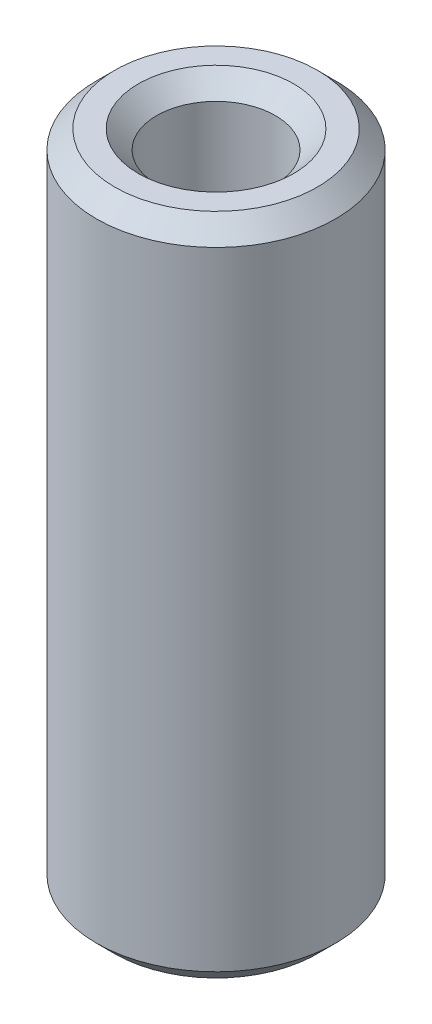
ISO-10303-21;
HEADER;
FILE_DESCRIPTION(('STEP AP214'),'2;1');
FILE_NAME('part.step','',(''),(''),'','','');
FILE_SCHEMA(('AUTOMOTIVE_DESIGN { 1 0 10303 214 1 1 1 1 }'));
ENDSEC;
DATA;
#1=APPLICATION_CONTEXT('core data for automotive mechanical design processes');
#2=APPLICATION_PROTOCOL_DEFINITION('international standard','automotive_design',2000,#1);
#3=PRODUCT_CONTEXT('',#1,'mechanical');
#4=PRODUCT('Part','Part','',(#3));
#5=PRODUCT_RELATED_PRODUCT_CATEGORY('part','',(#4));
#6=PRODUCT_DEFINITION_FORMATION('','',#4);
#7=PRODUCT_DEFINITION_CONTEXT('part definition',#1,'design');
#8=PRODUCT_DEFINITION('design','',#6,#7);
#9=PRODUCT_DEFINITION_SHAPE('','',#8);
#10=(LENGTH_UNIT() NAMED_UNIT(*) SI_UNIT(.MILLI.,.METRE.));
#11=(NAMED_UNIT(*) PLANE_ANGLE_UNIT() SI_UNIT($,.RADIAN.));
#12=(NAMED_UNIT(*) SI_UNIT($,.STERADIAN.) SOLID_ANGLE_UNIT());
#13=UNCERTAINTY_MEASURE_WITH_UNIT(LENGTH_MEASURE(1.E-05),#10,'distance_accuracy_value','');
#14=(GEOMETRIC_REPRESENTATION_CONTEXT(3) GLOBAL_UNCERTAINTY_ASSIGNED_CONTEXT((#13)) GLOBAL_UNIT_ASSIGNED_CONTEXT((#10,
#11,#12)) REPRESENTATION_CONTEXT('',''));
#15=CARTESIAN_POINT('',(0.,0.,0.));
#16=DIRECTION('',(0.,0.,1.));
#17=DIRECTION('',(1.,0.,0.));
#18=AXIS2_PLACEMENT_3D('',#15,#16,#17);
#19=CARTESIAN_POINT('',(0.,138.766618635159,0.));
#20=DIRECTION('',(0.,-1.,0.));
#21=DIRECTION('',(0.,0.,-1.));
#22=AXIS2_PLACEMENT_3D('',#19,#20,#21);
#23=CYLINDRICAL_SURFACE('',#22,25.);
#24=CARTESIAN_POINT('',(0.,3.83094372127921,0.));
#25=DIRECTION('',(0.,1.,0.));
#26=DIRECTION('',(0.,0.,1.));
#27=AXIS2_PLACEMENT_3D('',#24,#25,#26);
#28=CIRCLE('',#27,25.);
#29=CARTESIAN_POINT('',(0.,3.83094372127921,25.));
#30=VERTEX_POINT('',#29);
#31=EDGE_CURVE('E10',#30,#30,#28,.T.);
#32=ORIENTED_EDGE('',*,*,#31,.T.);
#33=EDGE_LOOP('',(#32));
#34=FACE_BOUND('',#33,.T.);
#35=CARTESIAN_POINT('',(0.,134.93567491388,0.));
#36=DIRECTION('',(0.,1.,0.));
#37=DIRECTION('',(0.,0.,1.));
#38=AXIS2_PLACEMENT_3D('',#35,#36,#37);
#39=CIRCLE('',#38,25.);
#40=CARTESIAN_POINT('',(0.,134.93567491388,25.));
#41=VERTEX_POINT('',#40);
#42=EDGE_CURVE('E50',#41,#41,#39,.F.);
#43=ORIENTED_EDGE('',*,*,#42,.T.);
#44=EDGE_LOOP('',(#43));
#45=FACE_BOUND('',#44,.T.);
#46=ADVANCED_FACE('F39',(#34,#45),#23,.T.);
#47=CARTESIAN_POINT('',(0.,138.766618635159,0.));
#48=DIRECTION('',(0.,1.,0.));
#49=DIRECTION('',(0.,0.,1.));
#50=AXIS2_PLACEMENT_3D('',#47,#48,#49);
#51=PLANE('',#50);
#52=CARTESIAN_POINT('',(0.,138.766618635159,0.));
#53=DIRECTION('',(0.,1.,0.));
#54=DIRECTION('',(0.,0.,1.));
#55=AXIS2_PLACEMENT_3D('',#52,#53,#54);
#56=CIRCLE('',#55,16.2453416681591);
#57=CARTESIAN_POINT('',(0.,138.766618635159,16.2453416681591));
#58=VERTEX_POINT('',#57);
#59=EDGE_CURVE('E58',#58,#58,#56,.F.);
#60=ORIENTED_EDGE('',*,*,#59,.T.);
#61=EDGE_LOOP('',(#60));
#62=FACE_BOUND('',#61,.T.);
#63=CARTESIAN_POINT('',(0.,138.766618635159,0.));
#64=DIRECTION('',(0.,1.,0.));
#65=DIRECTION('',(0.,0.,1.));
#66=AXIS2_PLACEMENT_3D('',#63,#64,#65);
#67=CIRCLE('',#66,21.1690562787208);
#68=CARTESIAN_POINT('',(0.,138.766618635159,21.1690562787208));
#69=VERTEX_POINT('',#68);
#70=EDGE_CURVE('E61',#69,#69,#67,.T.);
#71=ORIENTED_EDGE('',*,*,#70,.T.);
#72=EDGE_LOOP('',(#71));
#73=FACE_BOUND('',#72,.T.);
#74=ADVANCED_FACE('F88',(#62,#73),#51,.T.);
#75=CARTESIAN_POINT('',(0.,0.,0.));
#76=DIRECTION('',(0.,1.,0.));
#77=DIRECTION('',(0.,0.,1.));
#78=AXIS2_PLACEMENT_3D('',#75,#76,#77);
#79=PLANE('',#78);
#80=CARTESIAN_POINT('',(0.,0.,0.));
#81=DIRECTION('',(0.,1.,0.));
#82=DIRECTION('',(0.,0.,1.));
#83=AXIS2_PLACEMENT_3D('',#80,#81,#82);
#84=CIRCLE('',#83,16.2453416681591);
#85=CARTESIAN_POINT('',(0.,0.,16.2453416681591));
#86=VERTEX_POINT('',#85);
#87=EDGE_CURVE('E51',#86,#86,#84,.T.);
#88=ORIENTED_EDGE('',*,*,#87,.T.);
#89=EDGE_LOOP('',(#88));
#90=FACE_BOUND('',#89,.T.);
#91=CARTESIAN_POINT('',(0.,0.,0.));
#92=DIRECTION('',(0.,1.,0.));
#93=DIRECTION('',(0.,0.,1.));
#94=AXIS2_PLACEMENT_3D('',#91,#92,#93);
#95=CIRCLE('',#94,21.1690562787208);
#96=CARTESIAN_POINT('',(0.,0.,21.1690562787208));
#97=VERTEX_POINT('',#96);
#98=EDGE_CURVE('E54',#97,#97,#95,.F.);
#99=ORIENTED_EDGE('',*,*,#98,.T.);
#100=EDGE_LOOP('',(#99));
#101=FACE_BOUND('',#100,.T.);
#102=ADVANCED_FACE('F83',(#90,#101),#79,.F.);
#103=CARTESIAN_POINT('',(0.,138.766618635159,0.));
#104=DIRECTION('',(0.,-1.,0.));
#105=DIRECTION('',(0.,0.,-1.));
#106=AXIS2_PLACEMENT_3D('',#103,#104,#105);
#107=CYLINDRICAL_SURFACE('',#106,12.4143979468798);
#108=CARTESIAN_POINT('',(0.,134.93567491388,0.));
#109=DIRECTION('',(0.,1.,0.));
#110=DIRECTION('',(0.,0.,1.));
#111=AXIS2_PLACEMENT_3D('',#108,#109,#110);
#112=CIRCLE('',#111,12.4143979468798);
#113=CARTESIAN_POINT('',(0.,134.93567491388,12.4143979468798));
#114=VERTEX_POINT('',#113);
#115=EDGE_CURVE('E67',#114,#114,#112,.T.);
#116=ORIENTED_EDGE('',*,*,#115,.T.);
#117=EDGE_LOOP('',(#116));
#118=FACE_BOUND('',#117,.T.);
#119=CARTESIAN_POINT('',(0.,3.83094372127926,0.));
#120=DIRECTION('',(0.,1.,0.));
#121=DIRECTION('',(0.,0.,1.));
#122=AXIS2_PLACEMENT_3D('',#119,#120,#121);
#123=CIRCLE('',#122,12.4143979468798);
#124=CARTESIAN_POINT('',(0.,3.83094372127926,12.4143979468798));
#125=VERTEX_POINT('',#124);
#126=EDGE_CURVE('E69',#125,#125,#123,.F.);
#127=ORIENTED_EDGE('',*,*,#126,.T.);
#128=EDGE_LOOP('',(#127));
#129=FACE_BOUND('',#128,.T.);
#130=ADVANCED_FACE('F71',(#118,#129),#107,.F.);
#131=CARTESIAN_POINT('',(0.,134.93567491388,0.));
#132=DIRECTION('',(0.,1.,0.));
#133=DIRECTION('',(0.,0.,1.));
#134=AXIS2_PLACEMENT_3D('',#131,#132,#133);
#135=CONICAL_SURFACE('',#134,12.4143979468798,0.785398163397447);
#136=ORIENTED_EDGE('',*,*,#59,.F.);
#137=EDGE_LOOP('',(#136));
#138=FACE_BOUND('',#137,.T.);
#139=ORIENTED_EDGE('',*,*,#115,.F.);
#140=EDGE_LOOP('',(#139));
#141=FACE_BOUND('',#140,.T.);
#142=ADVANCED_FACE('F77',(#138,#141),#135,.F.);
#143=CARTESIAN_POINT('',(0.,0.,0.));
#144=DIRECTION('',(0.,-1.,0.));
#145=DIRECTION('',(0.,0.,-1.));
#146=AXIS2_PLACEMENT_3D('',#143,#144,#145);
#147=CONICAL_SURFACE('',#146,16.2453416681591,0.785398163397445);
#148=ORIENTED_EDGE('',*,*,#126,.F.);
#149=EDGE_LOOP('',(#148));
#150=FACE_BOUND('',#149,.T.);
#151=ORIENTED_EDGE('',*,*,#87,.F.);
#152=EDGE_LOOP('',(#151));
#153=FACE_BOUND('',#152,.T.);
#154=ADVANCED_FACE('F73',(#150,#153),#147,.F.);
#155=CARTESIAN_POINT('',(0.,3.83094372127921,0.));
#156=DIRECTION('',(0.,1.,0.));
#157=DIRECTION('',(0.,0.,1.));
#158=AXIS2_PLACEMENT_3D('',#155,#156,#157);
#159=CONICAL_SURFACE('',#158,25.,0.785398163397452);
#160=ORIENTED_EDGE('',*,*,#98,.F.);
#161=EDGE_LOOP('',(#160));
#162=FACE_BOUND('',#161,.T.);
#163=ORIENTED_EDGE('',*,*,#31,.F.);
#164=EDGE_LOOP('',(#163));
#165=FACE_BOUND('',#164,.T.);
#166=ADVANCED_FACE('F76',(#162,#165),#159,.T.);
#167=CARTESIAN_POINT('',(0.,138.766618635159,0.));
#168=DIRECTION('',(0.,-1.,0.));
#169=DIRECTION('',(0.,0.,-1.));
#170=AXIS2_PLACEMENT_3D('',#167,#168,#169);
#171=CONICAL_SURFACE('',#170,21.1690562787208,0.785398163397442);
#172=ORIENTED_EDGE('',*,*,#42,.F.);
#173=EDGE_LOOP('',(#172));
#174=FACE_BOUND('',#173,.T.);
#175=ORIENTED_EDGE('',*,*,#70,.F.);
#176=EDGE_LOOP('',(#175));
#177=FACE_BOUND('',#176,.T.);
#178=ADVANCED_FACE('F45',(#174,#177),#171,.T.);
#179=CLOSED_SHELL('',(#46,#74,#102,#130,#142,#154,#166,#178));
#180=MANIFOLD_SOLID_BREP('B2',#179);
#181=ADVANCED_BREP_SHAPE_REPRESENTATION('',(#18,#180),#14);
#182=SHAPE_DEFINITION_REPRESENTATION(#9,#181);
ENDSEC;
END-ISO-10303-21;
